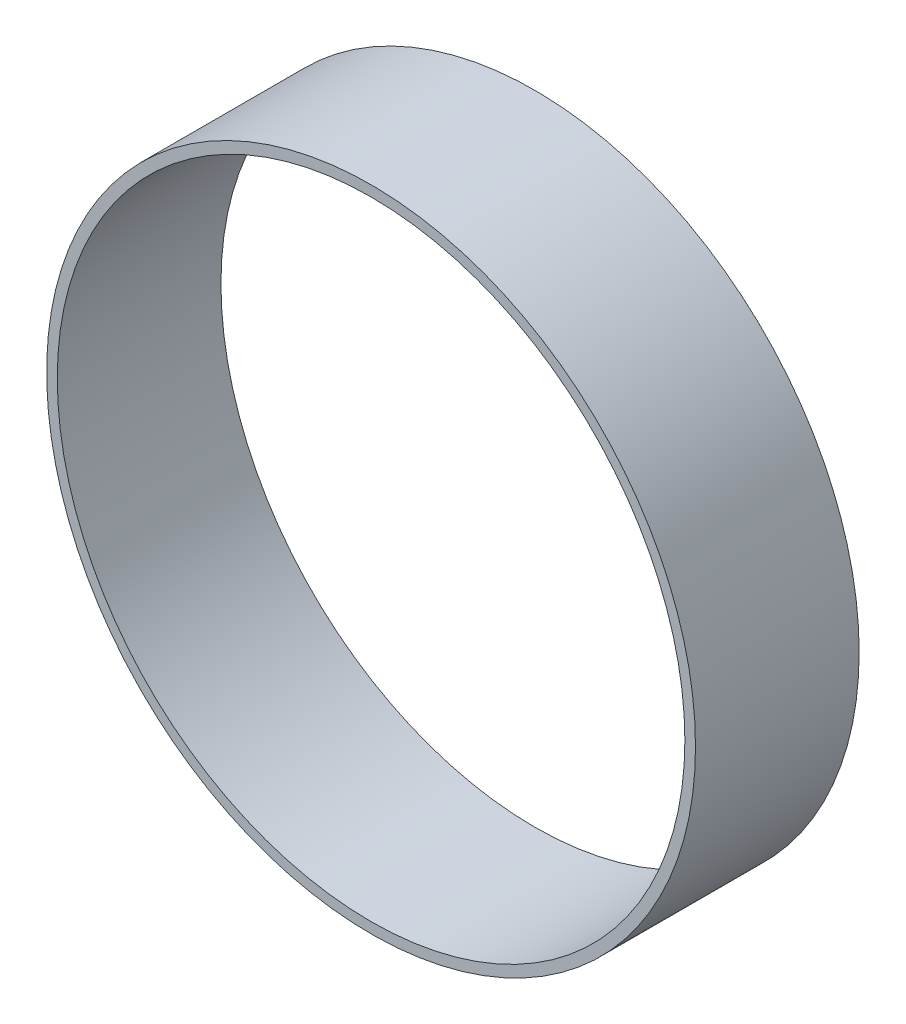
ISO-10303-21;
HEADER;
FILE_DESCRIPTION(('STEP AP214'),'2;1');
FILE_NAME('part.step','',(''),(''),'','','');
FILE_SCHEMA(('AUTOMOTIVE_DESIGN { 1 0 10303 214 1 1 1 1 }'));
ENDSEC;
DATA;
#1=APPLICATION_CONTEXT('core data for automotive mechanical design processes');
#2=APPLICATION_PROTOCOL_DEFINITION('international standard','automotive_design',2000,#1);
#3=PRODUCT_CONTEXT('',#1,'mechanical');
#4=PRODUCT('Part','Part','',(#3));
#5=PRODUCT_RELATED_PRODUCT_CATEGORY('part','',(#4));
#6=PRODUCT_DEFINITION_FORMATION('','',#4);
#7=PRODUCT_DEFINITION_CONTEXT('part definition',#1,'design');
#8=PRODUCT_DEFINITION('design','',#6,#7);
#9=PRODUCT_DEFINITION_SHAPE('','',#8);
#10=(LENGTH_UNIT() NAMED_UNIT(*) SI_UNIT(.MILLI.,.METRE.));
#11=(NAMED_UNIT(*) PLANE_ANGLE_UNIT() SI_UNIT($,.RADIAN.));
#12=(NAMED_UNIT(*) SI_UNIT($,.STERADIAN.) SOLID_ANGLE_UNIT());
#13=UNCERTAINTY_MEASURE_WITH_UNIT(LENGTH_MEASURE(1.E-05),#10,'distance_accuracy_value','');
#14=(GEOMETRIC_REPRESENTATION_CONTEXT(3) GLOBAL_UNCERTAINTY_ASSIGNED_CONTEXT((#13)) GLOBAL_UNIT_ASSIGNED_CONTEXT((#10,
#11,#12)) REPRESENTATION_CONTEXT('',''));
#15=CARTESIAN_POINT('',(0.,0.,0.));
#16=DIRECTION('',(0.,0.,1.));
#17=DIRECTION('',(1.,0.,0.));
#18=AXIS2_PLACEMENT_3D('',#15,#16,#17);
#19=CARTESIAN_POINT('',(0.,0.,0.));
#20=DIRECTION('',(0.,0.,-1.));
#21=DIRECTION('',(1.,0.,0.));
#22=AXIS2_PLACEMENT_3D('',#19,#20,#21);
#23=CYLINDRICAL_SURFACE('',#22,0.7753985);
#24=CARTESIAN_POINT('',(0.,0.,0.39116));
#25=DIRECTION('',(0.,0.,1.));
#26=DIRECTION('',(1.,0.,0.));
#27=AXIS2_PLACEMENT_3D('',#24,#25,#26);
#28=CIRCLE('',#27,0.7753985);
#29=CARTESIAN_POINT('',(0.7753985,0.,0.39116));
#30=VERTEX_POINT('',#29);
#31=EDGE_CURVE('E11',#30,#30,#28,.T.);
#32=ORIENTED_EDGE('',*,*,#31,.F.);
#33=DIRECTION('',(0.,0.,1.));
#34=VECTOR('',#33,1.);
#35=CARTESIAN_POINT('',(0.7753985,0.,0.));
#36=LINE('',#35,#34);
#37=CARTESIAN_POINT('',(0.7753985,0.,0.));
#38=VERTEX_POINT('',#37);
#39=EDGE_CURVE('E24',#38,#30,#36,.T.);
#40=ORIENTED_EDGE('',*,*,#39,.F.);
#41=CARTESIAN_POINT('',(0.,0.,0.));
#42=DIRECTION('',(0.,0.,1.));
#43=DIRECTION('',(1.,0.,0.));
#44=AXIS2_PLACEMENT_3D('',#41,#42,#43);
#45=CIRCLE('',#44,0.7753985);
#46=EDGE_CURVE('E46',#38,#38,#45,.T.);
#47=ORIENTED_EDGE('',*,*,#46,.T.);
#48=ORIENTED_EDGE('',*,*,#39,.T.);
#49=EDGE_LOOP('',(#32,#40,#47,#48));
#50=FACE_BOUND('',#49,.T.);
#51=ADVANCED_FACE('F17',(#50),#23,.T.);
#52=CARTESIAN_POINT('',(0.,0.,0.));
#53=DIRECTION('',(0.,0.,-1.));
#54=DIRECTION('',(1.,0.,0.));
#55=AXIS2_PLACEMENT_3D('',#52,#53,#54);
#56=CYLINDRICAL_SURFACE('',#55,0.7499985);
#57=DIRECTION('',(0.,0.,1.));
#58=VECTOR('',#57,1.);
#59=CARTESIAN_POINT('',(0.7499985,0.,0.));
#60=LINE('',#59,#58);
#61=CARTESIAN_POINT('',(0.7499985,0.,0.));
#62=VERTEX_POINT('',#61);
#63=CARTESIAN_POINT('',(0.7499985,0.,0.39116));
#64=VERTEX_POINT('',#63);
#65=EDGE_CURVE('E40',#62,#64,#60,.T.);
#66=ORIENTED_EDGE('',*,*,#65,.T.);
#67=CARTESIAN_POINT('',(0.,0.,0.39116));
#68=DIRECTION('',(0.,0.,1.));
#69=DIRECTION('',(1.,0.,0.));
#70=AXIS2_PLACEMENT_3D('',#67,#68,#69);
#71=CIRCLE('',#70,0.7499985);
#72=EDGE_CURVE('E45',#64,#64,#71,.T.);
#73=ORIENTED_EDGE('',*,*,#72,.T.);
#74=ORIENTED_EDGE('',*,*,#65,.F.);
#75=CARTESIAN_POINT('',(0.,0.,0.));
#76=DIRECTION('',(0.,0.,1.));
#77=DIRECTION('',(1.,0.,0.));
#78=AXIS2_PLACEMENT_3D('',#75,#76,#77);
#79=CIRCLE('',#78,0.7499985);
#80=EDGE_CURVE('E43',#62,#62,#79,.T.);
#81=ORIENTED_EDGE('',*,*,#80,.F.);
#82=EDGE_LOOP('',(#66,#73,#74,#81));
#83=FACE_BOUND('',#82,.T.);
#84=ADVANCED_FACE('F42',(#83),#56,.F.);
#85=CARTESIAN_POINT('',(0.7753985,0.,0.));
#86=DIRECTION('',(0.,0.,-1.));
#87=DIRECTION('',(-1.,0.,0.));
#88=AXIS2_PLACEMENT_3D('',#85,#86,#87);
#89=PLANE('',#88);
#90=ORIENTED_EDGE('',*,*,#46,.F.);
#91=EDGE_LOOP('',(#90));
#92=FACE_BOUND('',#91,.T.);
#93=ORIENTED_EDGE('',*,*,#80,.T.);
#94=EDGE_LOOP('',(#93));
#95=FACE_BOUND('',#94,.T.);
#96=ADVANCED_FACE('F49',(#92,#95),#89,.T.);
#97=CARTESIAN_POINT('',(0.7753985,0.,0.39116));
#98=DIRECTION('',(0.,0.,-1.));
#99=DIRECTION('',(-1.,0.,0.));
#100=AXIS2_PLACEMENT_3D('',#97,#98,#99);
#101=PLANE('',#100);
#102=ORIENTED_EDGE('',*,*,#31,.T.);
#103=EDGE_LOOP('',(#102));
#104=FACE_BOUND('',#103,.T.);
#105=ORIENTED_EDGE('',*,*,#72,.F.);
#106=EDGE_LOOP('',(#105));
#107=FACE_BOUND('',#106,.T.);
#108=ADVANCED_FACE('F56',(#104,#107),#101,.F.);
#109=CLOSED_SHELL('',(#51,#84,#96,#108));
#110=MANIFOLD_SOLID_BREP('B1',#109);
#111=ADVANCED_BREP_SHAPE_REPRESENTATION('',(#18,#110),#14);
#112=SHAPE_DEFINITION_REPRESENTATION(#9,#111);
ENDSEC;
END-ISO-10303-21;
